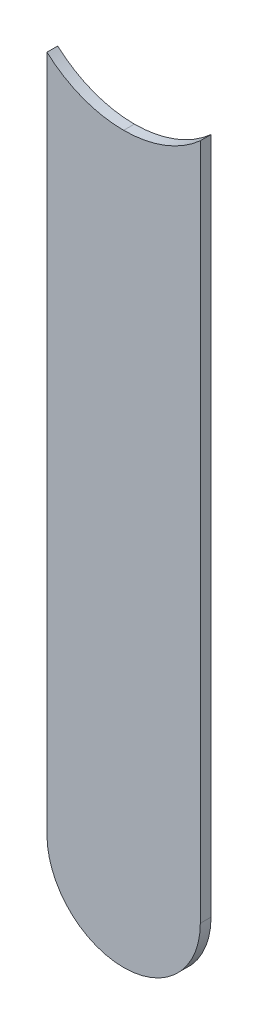
ISO-10303-21;
HEADER;
FILE_DESCRIPTION(('STEP AP214'),'2;1');
FILE_NAME('part.step','',(''),(''),'','','');
FILE_SCHEMA(('AUTOMOTIVE_DESIGN { 1 0 10303 214 1 1 1 1 }'));
ENDSEC;
DATA;
#1=APPLICATION_CONTEXT('core data for automotive mechanical design processes');
#2=APPLICATION_PROTOCOL_DEFINITION('international standard','automotive_design',2000,#1);
#3=PRODUCT_CONTEXT('',#1,'mechanical');
#4=PRODUCT('Part','Part','',(#3));
#5=PRODUCT_RELATED_PRODUCT_CATEGORY('part','',(#4));
#6=PRODUCT_DEFINITION_FORMATION('','',#4);
#7=PRODUCT_DEFINITION_CONTEXT('part definition',#1,'design');
#8=PRODUCT_DEFINITION('design','',#6,#7);
#9=PRODUCT_DEFINITION_SHAPE('','',#8);
#10=(LENGTH_UNIT() NAMED_UNIT(*) SI_UNIT(.MILLI.,.METRE.));
#11=(NAMED_UNIT(*) PLANE_ANGLE_UNIT() SI_UNIT($,.RADIAN.));
#12=(NAMED_UNIT(*) SI_UNIT($,.STERADIAN.) SOLID_ANGLE_UNIT());
#13=UNCERTAINTY_MEASURE_WITH_UNIT(LENGTH_MEASURE(1.E-05),#10,'distance_accuracy_value','');
#14=(GEOMETRIC_REPRESENTATION_CONTEXT(3) GLOBAL_UNCERTAINTY_ASSIGNED_CONTEXT((#13)) GLOBAL_UNIT_ASSIGNED_CONTEXT((#10,
#11,#12)) REPRESENTATION_CONTEXT('',''));
#15=CARTESIAN_POINT('',(0.,0.,0.));
#16=DIRECTION('',(0.,0.,1.));
#17=DIRECTION('',(1.,0.,0.));
#18=AXIS2_PLACEMENT_3D('',#15,#16,#17);
#19=CARTESIAN_POINT('',(149.86,-103.632,-0.045));
#20=DIRECTION('',(0.,0.,-1.));
#21=DIRECTION('',(0.,-1.,0.));
#22=AXIS2_PLACEMENT_3D('',#19,#20,#21);
#23=CYLINDRICAL_SURFACE('',#22,0.375);
#24=DIRECTION('',(0.,0.,1.));
#25=VECTOR('',#24,1.);
#26=CARTESIAN_POINT('',(149.86,-104.007,-0.045));
#27=LINE('',#26,#25);
#28=CARTESIAN_POINT('',(149.86,-104.007,-0.035));
#29=VERTEX_POINT('',#28);
#30=CARTESIAN_POINT('',(149.86,-104.007,0.));
#31=VERTEX_POINT('',#30);
#32=EDGE_CURVE('E75',#29,#31,#27,.T.);
#33=ORIENTED_EDGE('',*,*,#32,.F.);
#34=CARTESIAN_POINT('',(149.86,-103.632,-0.035));
#35=DIRECTION('',(0.,0.,-1.));
#36=DIRECTION('',(0.,-1.,0.));
#37=AXIS2_PLACEMENT_3D('',#34,#35,#36);
#38=CIRCLE('',#37,0.375);
#39=CARTESIAN_POINT('',(149.61,-103.9115084971,-0.035));
#40=VERTEX_POINT('',#39);
#41=EDGE_CURVE('E141',#29,#40,#38,.T.);
#42=ORIENTED_EDGE('',*,*,#41,.T.);
#43=DIRECTION('',(0.,0.,-1.));
#44=VECTOR('',#43,1.);
#45=CARTESIAN_POINT('',(149.61,-103.9115084971,-0.045));
#46=LINE('',#45,#44);
#47=CARTESIAN_POINT('',(149.61,-103.9115084971,0.));
#48=VERTEX_POINT('',#47);
#49=EDGE_CURVE('E11',#48,#40,#46,.T.);
#50=ORIENTED_EDGE('',*,*,#49,.F.);
#51=CARTESIAN_POINT('',(149.86,-103.632,0.));
#52=DIRECTION('',(0.,0.,-1.));
#53=DIRECTION('',(0.,-1.,0.));
#54=AXIS2_PLACEMENT_3D('',#51,#52,#53);
#55=CIRCLE('',#54,0.375);
#56=EDGE_CURVE('E72',#31,#48,#55,.T.);
#57=ORIENTED_EDGE('',*,*,#56,.F.);
#58=EDGE_LOOP('',(#33,#42,#50,#57));
#59=FACE_BOUND('',#58,.T.);
#60=ADVANCED_FACE('F17',(#59),#23,.F.);
#61=CARTESIAN_POINT('',(149.61,-103.632,-0.035));
#62=DIRECTION('',(1.,0.,0.));
#63=DIRECTION('',(0.,1.,0.));
#64=AXIS2_PLACEMENT_3D('',#61,#62,#63);
#65=PLANE('',#64);
#66=DIRECTION('',(0.,0.,1.));
#67=VECTOR('',#66,1.);
#68=CARTESIAN_POINT('',(149.61,-106.1212,-0.035));
#69=LINE('',#68,#67);
#70=CARTESIAN_POINT('',(149.61,-106.1212,-0.035));
#71=VERTEX_POINT('',#70);
#72=CARTESIAN_POINT('',(149.61,-106.1212,0.));
#73=VERTEX_POINT('',#72);
#74=EDGE_CURVE('E27',#71,#73,#69,.T.);
#75=ORIENTED_EDGE('',*,*,#74,.T.);
#76=DIRECTION('',(0.,-1.,0.));
#77=VECTOR('',#76,1.);
#78=CARTESIAN_POINT('',(149.61,-103.632,0.));
#79=LINE('',#78,#77);
#80=EDGE_CURVE('E20',#48,#73,#79,.T.);
#81=ORIENTED_EDGE('',*,*,#80,.F.);
#82=ORIENTED_EDGE('',*,*,#49,.T.);
#83=DIRECTION('',(0.,-1.,0.));
#84=VECTOR('',#83,1.);
#85=CARTESIAN_POINT('',(149.61,-103.632,-0.035));
#86=LINE('',#85,#84);
#87=EDGE_CURVE('E138',#40,#71,#86,.T.);
#88=ORIENTED_EDGE('',*,*,#87,.T.);
#89=EDGE_LOOP('',(#75,#81,#82,#88));
#90=FACE_BOUND('',#89,.T.);
#91=ADVANCED_FACE('F218',(#90),#65,.F.);
#92=CARTESIAN_POINT('',(149.86,-106.1212,-0.035));
#93=DIRECTION('',(0.,0.,-1.));
#94=DIRECTION('',(-1.,0.,0.));
#95=AXIS2_PLACEMENT_3D('',#92,#93,#94);
#96=CYLINDRICAL_SURFACE('',#95,0.25);
#97=CARTESIAN_POINT('',(149.86,-106.1212,-0.035));
#98=DIRECTION('',(0.,0.,1.));
#99=DIRECTION('',(-1.,0.,0.));
#100=AXIS2_PLACEMENT_3D('',#97,#98,#99);
#101=CIRCLE('',#100,0.25);
#102=CARTESIAN_POINT('',(150.11,-106.1212,-0.035));
#103=VERTEX_POINT('',#102);
#104=EDGE_CURVE('E95',#71,#103,#101,.T.);
#105=ORIENTED_EDGE('',*,*,#104,.T.);
#106=DIRECTION('',(0.,0.,1.));
#107=VECTOR('',#106,1.);
#108=CARTESIAN_POINT('',(150.11,-106.1212,-0.035));
#109=LINE('',#108,#107);
#110=CARTESIAN_POINT('',(150.11,-106.1212,0.));
#111=VERTEX_POINT('',#110);
#112=EDGE_CURVE('E118',#103,#111,#109,.T.);
#113=ORIENTED_EDGE('',*,*,#112,.T.);
#114=CARTESIAN_POINT('',(149.86,-106.1212,0.));
#115=DIRECTION('',(0.,0.,1.));
#116=DIRECTION('',(-1.,0.,0.));
#117=AXIS2_PLACEMENT_3D('',#114,#115,#116);
#118=CIRCLE('',#117,0.25);
#119=EDGE_CURVE('E80',#73,#111,#118,.T.);
#120=ORIENTED_EDGE('',*,*,#119,.F.);
#121=ORIENTED_EDGE('',*,*,#74,.F.);
#122=EDGE_LOOP('',(#105,#113,#120,#121));
#123=FACE_BOUND('',#122,.T.);
#124=ADVANCED_FACE('F115',(#123),#96,.T.);
#125=CARTESIAN_POINT('',(150.11,-106.1212,0.));
#126=DIRECTION('',(0.,0.,1.));
#127=DIRECTION('',(1.,0.,0.));
#128=AXIS2_PLACEMENT_3D('',#125,#126,#127);
#129=PLANE('',#128);
#130=ORIENTED_EDGE('',*,*,#119,.T.);
#131=DIRECTION('',(0.,1.,0.));
#132=VECTOR('',#131,1.);
#133=CARTESIAN_POINT('',(150.11,-106.1212,0.));
#134=LINE('',#133,#132);
#135=CARTESIAN_POINT('',(150.11,-103.9115084971,0.));
#136=VERTEX_POINT('',#135);
#137=EDGE_CURVE('E85',#111,#136,#134,.T.);
#138=ORIENTED_EDGE('',*,*,#137,.T.);
#139=CARTESIAN_POINT('',(149.86,-103.632,0.));
#140=DIRECTION('',(0.,0.,-1.));
#141=DIRECTION('',(0.,-1.,0.));
#142=AXIS2_PLACEMENT_3D('',#139,#140,#141);
#143=CIRCLE('',#142,0.375);
#144=EDGE_CURVE('E82',#136,#31,#143,.T.);
#145=ORIENTED_EDGE('',*,*,#144,.T.);
#146=ORIENTED_EDGE('',*,*,#56,.T.);
#147=ORIENTED_EDGE('',*,*,#80,.T.);
#148=EDGE_LOOP('',(#130,#138,#145,#146,#147));
#149=FACE_BOUND('',#148,.T.);
#150=ADVANCED_FACE('F83',(#149),#129,.T.);
#151=CARTESIAN_POINT('',(149.86,-103.632,-0.045));
#152=DIRECTION('',(0.,0.,-1.));
#153=DIRECTION('',(0.,-1.,0.));
#154=AXIS2_PLACEMENT_3D('',#151,#152,#153);
#155=CYLINDRICAL_SURFACE('',#154,0.375);
#156=CARTESIAN_POINT('',(149.86,-103.632,-0.035));
#157=DIRECTION('',(0.,0.,-1.));
#158=DIRECTION('',(0.,-1.,0.));
#159=AXIS2_PLACEMENT_3D('',#156,#157,#158);
#160=CIRCLE('',#159,0.375);
#161=CARTESIAN_POINT('',(150.11,-103.9115084971,-0.035));
#162=VERTEX_POINT('',#161);
#163=EDGE_CURVE('E92',#162,#29,#160,.T.);
#164=ORIENTED_EDGE('',*,*,#163,.T.);
#165=ORIENTED_EDGE('',*,*,#32,.T.);
#166=ORIENTED_EDGE('',*,*,#144,.F.);
#167=DIRECTION('',(0.,0.,-1.));
#168=VECTOR('',#167,1.);
#169=CARTESIAN_POINT('',(150.11,-103.9115084971,-0.045));
#170=LINE('',#169,#168);
#171=EDGE_CURVE('E157',#136,#162,#170,.T.);
#172=ORIENTED_EDGE('',*,*,#171,.T.);
#173=EDGE_LOOP('',(#164,#165,#166,#172));
#174=FACE_BOUND('',#173,.T.);
#175=ADVANCED_FACE('F91',(#174),#155,.F.);
#176=CARTESIAN_POINT('',(150.11,-106.1212,-0.035));
#177=DIRECTION('',(0.,0.,1.));
#178=DIRECTION('',(1.,0.,0.));
#179=AXIS2_PLACEMENT_3D('',#176,#177,#178);
#180=PLANE('',#179);
#181=ORIENTED_EDGE('',*,*,#87,.F.);
#182=ORIENTED_EDGE('',*,*,#41,.F.);
#183=ORIENTED_EDGE('',*,*,#163,.F.);
#184=DIRECTION('',(0.,1.,0.));
#185=VECTOR('',#184,1.);
#186=CARTESIAN_POINT('',(150.11,-106.1212,-0.035));
#187=LINE('',#186,#185);
#188=EDGE_CURVE('E134',#103,#162,#187,.T.);
#189=ORIENTED_EDGE('',*,*,#188,.F.);
#190=ORIENTED_EDGE('',*,*,#104,.F.);
#191=EDGE_LOOP('',(#181,#182,#183,#189,#190));
#192=FACE_BOUND('',#191,.T.);
#193=ADVANCED_FACE('F181',(#192),#180,.F.);
#194=CARTESIAN_POINT('',(150.11,-106.1212,-0.035));
#195=DIRECTION('',(-1.,0.,0.));
#196=DIRECTION('',(0.,0.,1.));
#197=AXIS2_PLACEMENT_3D('',#194,#195,#196);
#198=PLANE('',#197);
#199=ORIENTED_EDGE('',*,*,#171,.F.);
#200=ORIENTED_EDGE('',*,*,#137,.F.);
#201=ORIENTED_EDGE('',*,*,#112,.F.);
#202=ORIENTED_EDGE('',*,*,#188,.T.);
#203=EDGE_LOOP('',(#199,#200,#201,#202));
#204=FACE_BOUND('',#203,.T.);
#205=ADVANCED_FACE('F175',(#204),#198,.F.);
#206=CLOSED_SHELL('',(#60,#91,#124,#150,#175,#193,#205));
#207=MANIFOLD_SOLID_BREP('B1',#206);
#208=ADVANCED_BREP_SHAPE_REPRESENTATION('',(#18,#207),#14);
#209=SHAPE_DEFINITION_REPRESENTATION(#9,#208);
ENDSEC;
END-ISO-10303-21;
